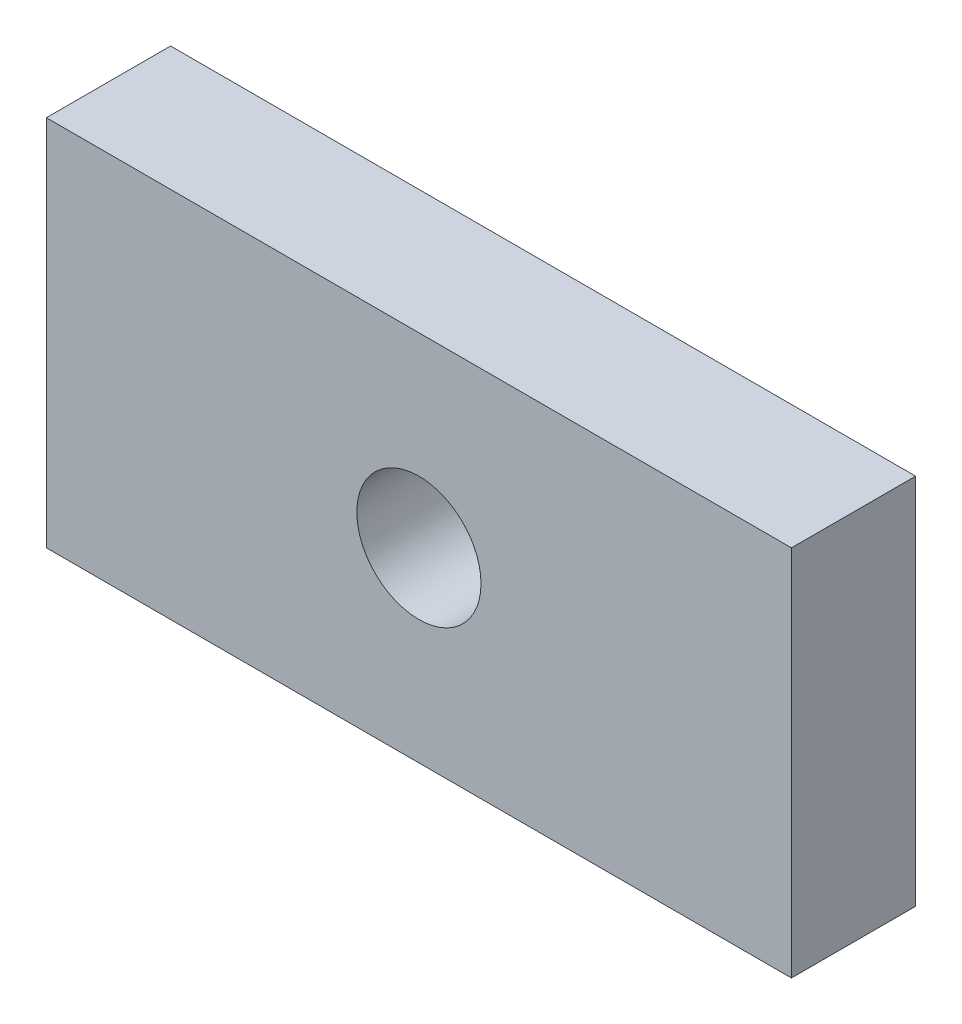
ISO-10303-21;
HEADER;
FILE_DESCRIPTION(('STEP AP214'),'2;1');
FILE_NAME('part.step','',(''),(''),'','','');
FILE_SCHEMA(('AUTOMOTIVE_DESIGN { 1 0 10303 214 1 1 1 1 }'));
ENDSEC;
DATA;
#1=APPLICATION_CONTEXT('core data for automotive mechanical design processes');
#2=APPLICATION_PROTOCOL_DEFINITION('international standard','automotive_design',2000,#1);
#3=PRODUCT_CONTEXT('',#1,'mechanical');
#4=PRODUCT('Part','Part','',(#3));
#5=PRODUCT_RELATED_PRODUCT_CATEGORY('part','',(#4));
#6=PRODUCT_DEFINITION_FORMATION('','',#4);
#7=PRODUCT_DEFINITION_CONTEXT('part definition',#1,'design');
#8=PRODUCT_DEFINITION('design','',#6,#7);
#9=PRODUCT_DEFINITION_SHAPE('','',#8);
#10=(LENGTH_UNIT() NAMED_UNIT(*) SI_UNIT(.MILLI.,.METRE.));
#11=(NAMED_UNIT(*) PLANE_ANGLE_UNIT() SI_UNIT($,.RADIAN.));
#12=(NAMED_UNIT(*) SI_UNIT($,.STERADIAN.) SOLID_ANGLE_UNIT());
#13=UNCERTAINTY_MEASURE_WITH_UNIT(LENGTH_MEASURE(1.E-05),#10,'distance_accuracy_value','');
#14=(GEOMETRIC_REPRESENTATION_CONTEXT(3) GLOBAL_UNCERTAINTY_ASSIGNED_CONTEXT((#13)) GLOBAL_UNIT_ASSIGNED_CONTEXT((#10,
#11,#12)) REPRESENTATION_CONTEXT('',''));
#15=CARTESIAN_POINT('',(0.,0.,0.));
#16=DIRECTION('',(0.,0.,1.));
#17=DIRECTION('',(1.,0.,0.));
#18=AXIS2_PLACEMENT_3D('',#15,#16,#17);
#19=CARTESIAN_POINT('',(0.,0.,12.7));
#20=DIRECTION('',(0.,0.,-1.));
#21=DIRECTION('',(-1.,0.,0.));
#22=AXIS2_PLACEMENT_3D('',#19,#20,#21);
#23=PLANE('',#22);
#24=DIRECTION('',(0.,-1.,0.));
#25=VECTOR('',#24,1.);
#26=CARTESIAN_POINT('',(0.,0.,12.7));
#27=LINE('',#26,#25);
#28=CARTESIAN_POINT('',(0.,38.1,12.7));
#29=VERTEX_POINT('',#28);
#30=CARTESIAN_POINT('',(0.,0.,12.7));
#31=VERTEX_POINT('',#30);
#32=EDGE_CURVE('E92',#29,#31,#27,.T.);
#33=ORIENTED_EDGE('',*,*,#32,.T.);
#34=DIRECTION('',(1.,0.,0.));
#35=VECTOR('',#34,1.);
#36=CARTESIAN_POINT('',(0.,0.,12.7));
#37=LINE('',#36,#35);
#38=CARTESIAN_POINT('',(76.2,0.,12.7));
#39=VERTEX_POINT('',#38);
#40=EDGE_CURVE('E87',#31,#39,#37,.T.);
#41=ORIENTED_EDGE('',*,*,#40,.T.);
#42=DIRECTION('',(0.,1.,0.));
#43=VECTOR('',#42,1.);
#44=CARTESIAN_POINT('',(76.2,0.,12.7));
#45=LINE('',#44,#43);
#46=CARTESIAN_POINT('',(76.2,38.1,12.7));
#47=VERTEX_POINT('',#46);
#48=EDGE_CURVE('E90',#39,#47,#45,.T.);
#49=ORIENTED_EDGE('',*,*,#48,.T.);
#50=DIRECTION('',(-1.,0.,0.));
#51=VECTOR('',#50,1.);
#52=CARTESIAN_POINT('',(0.,38.1,12.7));
#53=LINE('',#52,#51);
#54=EDGE_CURVE('E57',#47,#29,#53,.T.);
#55=ORIENTED_EDGE('',*,*,#54,.T.);
#56=EDGE_LOOP('',(#33,#41,#49,#55));
#57=FACE_BOUND('',#56,.T.);
#58=CARTESIAN_POINT('',(38.1,19.05,12.7));
#59=DIRECTION('',(0.,0.,1.));
#60=DIRECTION('',(1.,0.,0.));
#61=AXIS2_PLACEMENT_3D('',#58,#59,#60);
#62=CIRCLE('',#61,6.35);
#63=CARTESIAN_POINT('',(44.45,19.05,12.7));
#64=VERTEX_POINT('',#63);
#65=EDGE_CURVE('E112',#64,#64,#62,.T.);
#66=ORIENTED_EDGE('',*,*,#65,.F.);
#67=EDGE_LOOP('',(#66));
#68=FACE_BOUND('',#67,.T.);
#69=ADVANCED_FACE('F39',(#57,#68),#23,.F.);
#70=CARTESIAN_POINT('',(0.,0.,0.));
#71=DIRECTION('',(0.,0.,-1.));
#72=DIRECTION('',(-1.,0.,0.));
#73=AXIS2_PLACEMENT_3D('',#70,#71,#72);
#74=PLANE('',#73);
#75=DIRECTION('',(0.,-1.,0.));
#76=VECTOR('',#75,1.);
#77=CARTESIAN_POINT('',(0.,0.,0.));
#78=LINE('',#77,#76);
#79=CARTESIAN_POINT('',(0.,38.1,0.));
#80=VERTEX_POINT('',#79);
#81=CARTESIAN_POINT('',(0.,0.,0.));
#82=VERTEX_POINT('',#81);
#83=EDGE_CURVE('E108',#80,#82,#78,.T.);
#84=ORIENTED_EDGE('',*,*,#83,.F.);
#85=DIRECTION('',(-1.,0.,0.));
#86=VECTOR('',#85,1.);
#87=CARTESIAN_POINT('',(0.,38.1,0.));
#88=LINE('',#87,#86);
#89=CARTESIAN_POINT('',(76.2,38.1,0.));
#90=VERTEX_POINT('',#89);
#91=EDGE_CURVE('E80',#90,#80,#88,.T.);
#92=ORIENTED_EDGE('',*,*,#91,.F.);
#93=DIRECTION('',(0.,1.,0.));
#94=VECTOR('',#93,1.);
#95=CARTESIAN_POINT('',(76.2,0.,0.));
#96=LINE('',#95,#94);
#97=CARTESIAN_POINT('',(76.2,0.,0.));
#98=VERTEX_POINT('',#97);
#99=EDGE_CURVE('E74',#98,#90,#96,.T.);
#100=ORIENTED_EDGE('',*,*,#99,.F.);
#101=DIRECTION('',(1.,0.,0.));
#102=VECTOR('',#101,1.);
#103=CARTESIAN_POINT('',(0.,0.,0.));
#104=LINE('',#103,#102);
#105=EDGE_CURVE('E97',#82,#98,#104,.T.);
#106=ORIENTED_EDGE('',*,*,#105,.F.);
#107=EDGE_LOOP('',(#84,#92,#100,#106));
#108=FACE_BOUND('',#107,.T.);
#109=CARTESIAN_POINT('',(38.1,19.05,0.));
#110=DIRECTION('',(0.,0.,1.));
#111=DIRECTION('',(1.,0.,0.));
#112=AXIS2_PLACEMENT_3D('',#109,#110,#111);
#113=CIRCLE('',#112,6.35);
#114=CARTESIAN_POINT('',(44.45,19.05,0.));
#115=VERTEX_POINT('',#114);
#116=EDGE_CURVE('E130',#115,#115,#113,.T.);
#117=ORIENTED_EDGE('',*,*,#116,.T.);
#118=EDGE_LOOP('',(#117));
#119=FACE_BOUND('',#118,.T.);
#120=ADVANCED_FACE('F125',(#108,#119),#74,.T.);
#121=CARTESIAN_POINT('',(0.,0.,12.7));
#122=DIRECTION('',(1.,0.,0.));
#123=DIRECTION('',(0.,0.,-1.));
#124=AXIS2_PLACEMENT_3D('',#121,#122,#123);
#125=PLANE('',#124);
#126=ORIENTED_EDGE('',*,*,#83,.T.);
#127=DIRECTION('',(0.,0.,-1.));
#128=VECTOR('',#127,1.);
#129=CARTESIAN_POINT('',(0.,0.,12.7));
#130=LINE('',#129,#128);
#131=EDGE_CURVE('E11',#31,#82,#130,.T.);
#132=ORIENTED_EDGE('',*,*,#131,.F.);
#133=ORIENTED_EDGE('',*,*,#32,.F.);
#134=DIRECTION('',(0.,0.,-1.));
#135=VECTOR('',#134,1.);
#136=CARTESIAN_POINT('',(0.,38.1,12.7));
#137=LINE('',#136,#135);
#138=EDGE_CURVE('E104',#29,#80,#137,.T.);
#139=ORIENTED_EDGE('',*,*,#138,.T.);
#140=EDGE_LOOP('',(#126,#132,#133,#139));
#141=FACE_BOUND('',#140,.T.);
#142=ADVANCED_FACE('F41',(#141),#125,.F.);
#143=CARTESIAN_POINT('',(0.,0.,12.7));
#144=DIRECTION('',(0.,1.,0.));
#145=DIRECTION('',(0.,0.,1.));
#146=AXIS2_PLACEMENT_3D('',#143,#144,#145);
#147=PLANE('',#146);
#148=ORIENTED_EDGE('',*,*,#105,.T.);
#149=DIRECTION('',(0.,0.,-1.));
#150=VECTOR('',#149,1.);
#151=CARTESIAN_POINT('',(76.2,0.,12.7));
#152=LINE('',#151,#150);
#153=EDGE_CURVE('E49',#39,#98,#152,.T.);
#154=ORIENTED_EDGE('',*,*,#153,.F.);
#155=ORIENTED_EDGE('',*,*,#40,.F.);
#156=ORIENTED_EDGE('',*,*,#131,.T.);
#157=EDGE_LOOP('',(#148,#154,#155,#156));
#158=FACE_BOUND('',#157,.T.);
#159=ADVANCED_FACE('F96',(#158),#147,.F.);
#160=CARTESIAN_POINT('',(76.2,0.,12.7));
#161=DIRECTION('',(-1.,0.,0.));
#162=DIRECTION('',(0.,0.,1.));
#163=AXIS2_PLACEMENT_3D('',#160,#161,#162);
#164=PLANE('',#163);
#165=ORIENTED_EDGE('',*,*,#99,.T.);
#166=DIRECTION('',(0.,0.,-1.));
#167=VECTOR('',#166,1.);
#168=CARTESIAN_POINT('',(76.2,38.1,12.7));
#169=LINE('',#168,#167);
#170=EDGE_CURVE('E99',#47,#90,#169,.T.);
#171=ORIENTED_EDGE('',*,*,#170,.F.);
#172=ORIENTED_EDGE('',*,*,#48,.F.);
#173=ORIENTED_EDGE('',*,*,#153,.T.);
#174=EDGE_LOOP('',(#165,#171,#172,#173));
#175=FACE_BOUND('',#174,.T.);
#176=ADVANCED_FACE('F100',(#175),#164,.F.);
#177=CARTESIAN_POINT('',(0.,38.1,12.7));
#178=DIRECTION('',(0.,-1.,0.));
#179=DIRECTION('',(0.,0.,-1.));
#180=AXIS2_PLACEMENT_3D('',#177,#178,#179);
#181=PLANE('',#180);
#182=ORIENTED_EDGE('',*,*,#91,.T.);
#183=ORIENTED_EDGE('',*,*,#138,.F.);
#184=ORIENTED_EDGE('',*,*,#54,.F.);
#185=ORIENTED_EDGE('',*,*,#170,.T.);
#186=EDGE_LOOP('',(#182,#183,#184,#185));
#187=FACE_BOUND('',#186,.T.);
#188=ADVANCED_FACE('F122',(#187),#181,.F.);
#189=CARTESIAN_POINT('',(38.1,19.05,12.7));
#190=DIRECTION('',(0.,0.,-1.));
#191=DIRECTION('',(-1.,0.,0.));
#192=AXIS2_PLACEMENT_3D('',#189,#190,#191);
#193=CYLINDRICAL_SURFACE('',#192,6.35);
#194=ORIENTED_EDGE('',*,*,#65,.T.);
#195=EDGE_LOOP('',(#194));
#196=FACE_BOUND('',#195,.T.);
#197=ORIENTED_EDGE('',*,*,#116,.F.);
#198=EDGE_LOOP('',(#197));
#199=FACE_BOUND('',#198,.T.);
#200=ADVANCED_FACE('F138',(#196,#199),#193,.F.);
#201=CLOSED_SHELL('',(#69,#120,#142,#159,#176,#188,#200));
#202=MANIFOLD_SOLID_BREP('B2',#201);
#203=ADVANCED_BREP_SHAPE_REPRESENTATION('',(#18,#202),#14);
#204=SHAPE_DEFINITION_REPRESENTATION(#9,#203);
ENDSEC;
END-ISO-10303-21;
